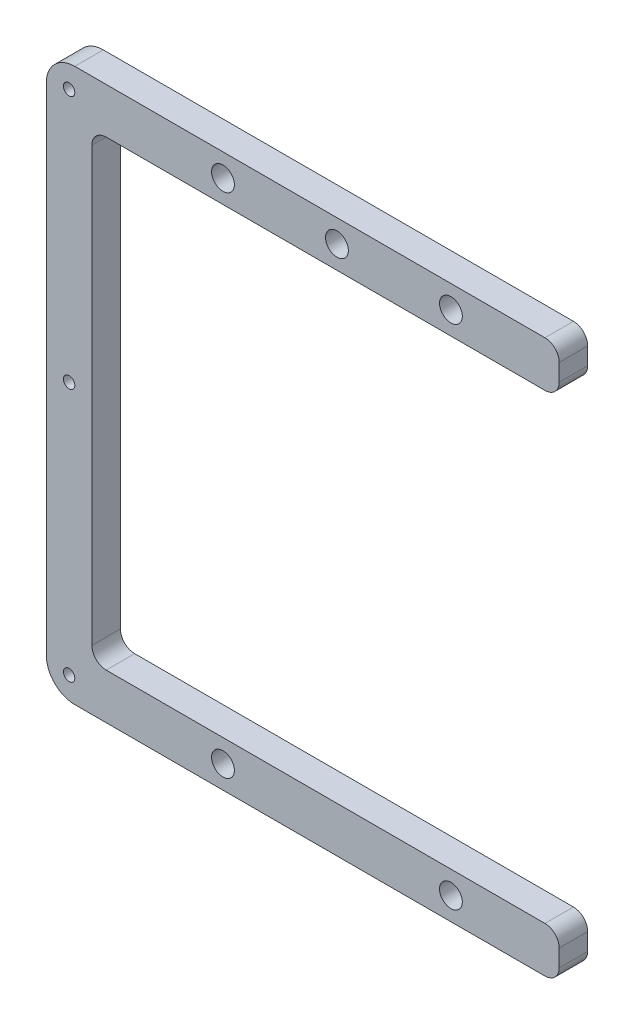
ISO-10303-21;
HEADER;
FILE_DESCRIPTION(('STEP AP214'),'2;1');
FILE_NAME('part.step','',(''),(''),'','','');
FILE_SCHEMA(('AUTOMOTIVE_DESIGN { 1 0 10303 214 1 1 1 1 }'));
ENDSEC;
DATA;
#1=APPLICATION_CONTEXT('core data for automotive mechanical design processes');
#2=APPLICATION_PROTOCOL_DEFINITION('international standard','automotive_design',2000,#1);
#3=PRODUCT_CONTEXT('',#1,'mechanical');
#4=PRODUCT('Part','Part','',(#3));
#5=PRODUCT_RELATED_PRODUCT_CATEGORY('part','',(#4));
#6=PRODUCT_DEFINITION_FORMATION('','',#4);
#7=PRODUCT_DEFINITION_CONTEXT('part definition',#1,'design');
#8=PRODUCT_DEFINITION('design','',#6,#7);
#9=PRODUCT_DEFINITION_SHAPE('','',#8);
#10=(LENGTH_UNIT() NAMED_UNIT(*) SI_UNIT(.MILLI.,.METRE.));
#11=(NAMED_UNIT(*) PLANE_ANGLE_UNIT() SI_UNIT($,.RADIAN.));
#12=(NAMED_UNIT(*) SI_UNIT($,.STERADIAN.) SOLID_ANGLE_UNIT());
#13=UNCERTAINTY_MEASURE_WITH_UNIT(LENGTH_MEASURE(1.E-05),#10,'distance_accuracy_value','');
#14=(GEOMETRIC_REPRESENTATION_CONTEXT(3) GLOBAL_UNCERTAINTY_ASSIGNED_CONTEXT((#13)) GLOBAL_UNIT_ASSIGNED_CONTEXT((#10,
#11,#12)) REPRESENTATION_CONTEXT('',''));
#15=CARTESIAN_POINT('',(0.,0.,0.));
#16=DIRECTION('',(0.,0.,1.));
#17=DIRECTION('',(1.,0.,0.));
#18=AXIS2_PLACEMENT_3D('',#15,#16,#17);
#19=CARTESIAN_POINT('',(5.,-43.5,5.));
#20=DIRECTION('',(0.,0.,-1.));
#21=DIRECTION('',(-1.,0.,0.));
#22=AXIS2_PLACEMENT_3D('',#19,#20,#21);
#23=CYLINDRICAL_SURFACE('',#22,5.);
#24=CARTESIAN_POINT('',(5.,-43.5,0.));
#25=DIRECTION('',(0.,0.,1.));
#26=DIRECTION('',(1.,0.,0.));
#27=AXIS2_PLACEMENT_3D('',#24,#25,#26);
#28=CIRCLE('',#27,5.);
#29=CARTESIAN_POINT('',(0.,-43.5,0.));
#30=VERTEX_POINT('',#29);
#31=CARTESIAN_POINT('',(5.00000000000001,-48.5,0.));
#32=VERTEX_POINT('',#31);
#33=EDGE_CURVE('E183',#30,#32,#28,.T.);
#34=ORIENTED_EDGE('',*,*,#33,.T.);
#35=DIRECTION('',(0.,0.,-1.));
#36=VECTOR('',#35,1.);
#37=CARTESIAN_POINT('',(5.00000000000001,-48.5,5.));
#38=LINE('',#37,#36);
#39=CARTESIAN_POINT('',(5.00000000000001,-48.5,5.));
#40=VERTEX_POINT('',#39);
#41=EDGE_CURVE('E11',#40,#32,#38,.T.);
#42=ORIENTED_EDGE('',*,*,#41,.F.);
#43=CARTESIAN_POINT('',(5.,-43.5,5.));
#44=DIRECTION('',(0.,0.,1.));
#45=DIRECTION('',(1.,0.,0.));
#46=AXIS2_PLACEMENT_3D('',#43,#44,#45);
#47=CIRCLE('',#46,5.);
#48=CARTESIAN_POINT('',(0.,-43.5,5.));
#49=VERTEX_POINT('',#48);
#50=EDGE_CURVE('E214',#49,#40,#47,.T.);
#51=ORIENTED_EDGE('',*,*,#50,.F.);
#52=DIRECTION('',(0.,0.,-1.));
#53=VECTOR('',#52,1.);
#54=CARTESIAN_POINT('',(0.,-43.5,5.));
#55=LINE('',#54,#53);
#56=EDGE_CURVE('E179',#49,#30,#55,.T.);
#57=ORIENTED_EDGE('',*,*,#56,.T.);
#58=EDGE_LOOP('',(#34,#42,#51,#57));
#59=FACE_BOUND('',#58,.T.);
#60=ADVANCED_FACE('F39',(#59),#23,.T.);
#61=CARTESIAN_POINT('',(87.5,-48.5,5.));
#62=DIRECTION('',(0.,1.,0.));
#63=DIRECTION('',(-1.,0.,0.));
#64=AXIS2_PLACEMENT_3D('',#61,#62,#63);
#65=PLANE('',#64);
#66=DIRECTION('',(1.,0.,0.));
#67=VECTOR('',#66,1.);
#68=CARTESIAN_POINT('',(87.5,-48.5,0.));
#69=LINE('',#68,#67);
#70=CARTESIAN_POINT('',(87.5,-48.5,0.));
#71=VERTEX_POINT('',#70);
#72=EDGE_CURVE('E186',#32,#71,#69,.T.);
#73=ORIENTED_EDGE('',*,*,#72,.T.);
#74=DIRECTION('',(0.,0.,-1.));
#75=VECTOR('',#74,1.);
#76=CARTESIAN_POINT('',(87.5,-48.5,5.));
#77=LINE('',#76,#75);
#78=CARTESIAN_POINT('',(87.5,-48.5,5.));
#79=VERTEX_POINT('',#78);
#80=EDGE_CURVE('E47',#79,#71,#77,.T.);
#81=ORIENTED_EDGE('',*,*,#80,.F.);
#82=DIRECTION('',(1.,0.,0.));
#83=VECTOR('',#82,1.);
#84=CARTESIAN_POINT('',(87.5,-48.5,5.));
#85=LINE('',#84,#83);
#86=EDGE_CURVE('E122',#40,#79,#85,.T.);
#87=ORIENTED_EDGE('',*,*,#86,.F.);
#88=ORIENTED_EDGE('',*,*,#41,.T.);
#89=EDGE_LOOP('',(#73,#81,#87,#88));
#90=FACE_BOUND('',#89,.T.);
#91=ADVANCED_FACE('F313',(#90),#65,.F.);
#92=CARTESIAN_POINT('',(87.5,-46.,5.));
#93=DIRECTION('',(0.,0.,-1.));
#94=DIRECTION('',(-1.,0.,0.));
#95=AXIS2_PLACEMENT_3D('',#92,#93,#94);
#96=CYLINDRICAL_SURFACE('',#95,2.5);
#97=CARTESIAN_POINT('',(87.5,-46.,0.));
#98=DIRECTION('',(0.,0.,1.));
#99=DIRECTION('',(-1.,0.,0.));
#100=AXIS2_PLACEMENT_3D('',#97,#98,#99);
#101=CIRCLE('',#100,2.5);
#102=CARTESIAN_POINT('',(90.,-46.,0.));
#103=VERTEX_POINT('',#102);
#104=EDGE_CURVE('E189',#71,#103,#101,.T.);
#105=ORIENTED_EDGE('',*,*,#104,.T.);
#106=DIRECTION('',(0.,0.,-1.));
#107=VECTOR('',#106,1.);
#108=CARTESIAN_POINT('',(90.,-46.,5.));
#109=LINE('',#108,#107);
#110=CARTESIAN_POINT('',(90.,-46.,5.));
#111=VERTEX_POINT('',#110);
#112=EDGE_CURVE('E245',#111,#103,#109,.T.);
#113=ORIENTED_EDGE('',*,*,#112,.F.);
#114=CARTESIAN_POINT('',(87.5,-46.,5.));
#115=DIRECTION('',(0.,0.,1.));
#116=DIRECTION('',(-1.,0.,0.));
#117=AXIS2_PLACEMENT_3D('',#114,#115,#116);
#118=CIRCLE('',#117,2.5);
#119=EDGE_CURVE('E253',#79,#111,#118,.T.);
#120=ORIENTED_EDGE('',*,*,#119,.F.);
#121=ORIENTED_EDGE('',*,*,#80,.T.);
#122=EDGE_LOOP('',(#105,#113,#120,#121));
#123=FACE_BOUND('',#122,.T.);
#124=ADVANCED_FACE('F251',(#123),#96,.T.);
#125=CARTESIAN_POINT('',(90.,-43.,5.));
#126=DIRECTION('',(-1.,0.,0.));
#127=DIRECTION('',(0.,-1.,0.));
#128=AXIS2_PLACEMENT_3D('',#125,#126,#127);
#129=PLANE('',#128);
#130=DIRECTION('',(0.,1.,0.));
#131=VECTOR('',#130,1.);
#132=CARTESIAN_POINT('',(90.,-43.,0.));
#133=LINE('',#132,#131);
#134=CARTESIAN_POINT('',(90.,-43.,0.));
#135=VERTEX_POINT('',#134);
#136=EDGE_CURVE('E191',#103,#135,#133,.T.);
#137=ORIENTED_EDGE('',*,*,#136,.T.);
#138=DIRECTION('',(0.,0.,-1.));
#139=VECTOR('',#138,1.);
#140=CARTESIAN_POINT('',(90.,-43.,5.));
#141=LINE('',#140,#139);
#142=CARTESIAN_POINT('',(90.,-43.,5.));
#143=VERTEX_POINT('',#142);
#144=EDGE_CURVE('E242',#143,#135,#141,.T.);
#145=ORIENTED_EDGE('',*,*,#144,.F.);
#146=DIRECTION('',(0.,1.,0.));
#147=VECTOR('',#146,1.);
#148=CARTESIAN_POINT('',(90.,-43.,5.));
#149=LINE('',#148,#147);
#150=EDGE_CURVE('E271',#111,#143,#149,.T.);
#151=ORIENTED_EDGE('',*,*,#150,.F.);
#152=ORIENTED_EDGE('',*,*,#112,.T.);
#153=EDGE_LOOP('',(#137,#145,#151,#152));
#154=FACE_BOUND('',#153,.T.);
#155=ADVANCED_FACE('F262',(#154),#129,.F.);
#156=CARTESIAN_POINT('',(87.5,-43.,5.));
#157=DIRECTION('',(0.,0.,-1.));
#158=DIRECTION('',(-1.,0.,0.));
#159=AXIS2_PLACEMENT_3D('',#156,#157,#158);
#160=CYLINDRICAL_SURFACE('',#159,2.50000000000001);
#161=CARTESIAN_POINT('',(87.5,-43.,0.));
#162=DIRECTION('',(0.,0.,1.));
#163=DIRECTION('',(1.,0.,0.));
#164=AXIS2_PLACEMENT_3D('',#161,#162,#163);
#165=CIRCLE('',#164,2.50000000000001);
#166=CARTESIAN_POINT('',(87.5,-40.5,0.));
#167=VERTEX_POINT('',#166);
#168=EDGE_CURVE('E193',#135,#167,#165,.T.);
#169=ORIENTED_EDGE('',*,*,#168,.T.);
#170=DIRECTION('',(0.,0.,-1.));
#171=VECTOR('',#170,1.);
#172=CARTESIAN_POINT('',(87.5,-40.5,5.));
#173=LINE('',#172,#171);
#174=CARTESIAN_POINT('',(87.5,-40.5,5.));
#175=VERTEX_POINT('',#174);
#176=EDGE_CURVE('E239',#175,#167,#173,.T.);
#177=ORIENTED_EDGE('',*,*,#176,.F.);
#178=CARTESIAN_POINT('',(87.5,-43.,5.));
#179=DIRECTION('',(0.,0.,1.));
#180=DIRECTION('',(1.,0.,0.));
#181=AXIS2_PLACEMENT_3D('',#178,#179,#180);
#182=CIRCLE('',#181,2.50000000000001);
#183=EDGE_CURVE('E268',#143,#175,#182,.T.);
#184=ORIENTED_EDGE('',*,*,#183,.F.);
#185=ORIENTED_EDGE('',*,*,#144,.T.);
#186=EDGE_LOOP('',(#169,#177,#184,#185));
#187=FACE_BOUND('',#186,.T.);
#188=ADVANCED_FACE('F266',(#187),#160,.T.);
#189=CARTESIAN_POINT('',(10.5,-40.5,5.));
#190=DIRECTION('',(0.,-1.,0.));
#191=DIRECTION('',(1.,0.,0.));
#192=AXIS2_PLACEMENT_3D('',#189,#190,#191);
#193=PLANE('',#192);
#194=DIRECTION('',(-1.,0.,0.));
#195=VECTOR('',#194,1.);
#196=CARTESIAN_POINT('',(10.5,-40.5,0.));
#197=LINE('',#196,#195);
#198=CARTESIAN_POINT('',(10.5,-40.5,0.));
#199=VERTEX_POINT('',#198);
#200=EDGE_CURVE('E195',#167,#199,#197,.T.);
#201=ORIENTED_EDGE('',*,*,#200,.T.);
#202=DIRECTION('',(0.,0.,-1.));
#203=VECTOR('',#202,1.);
#204=CARTESIAN_POINT('',(10.5,-40.5,5.));
#205=LINE('',#204,#203);
#206=CARTESIAN_POINT('',(10.5,-40.5,5.));
#207=VERTEX_POINT('',#206);
#208=EDGE_CURVE('E236',#207,#199,#205,.T.);
#209=ORIENTED_EDGE('',*,*,#208,.F.);
#210=DIRECTION('',(-1.,0.,0.));
#211=VECTOR('',#210,1.);
#212=CARTESIAN_POINT('',(10.5,-40.5,5.));
#213=LINE('',#212,#211);
#214=EDGE_CURVE('E270',#175,#207,#213,.T.);
#215=ORIENTED_EDGE('',*,*,#214,.F.);
#216=ORIENTED_EDGE('',*,*,#176,.T.);
#217=EDGE_LOOP('',(#201,#209,#215,#216));
#218=FACE_BOUND('',#217,.T.);
#219=ADVANCED_FACE('F326',(#218),#193,.F.);
#220=CARTESIAN_POINT('',(10.5,-38.,5.));
#221=DIRECTION('',(0.,0.,-1.));
#222=DIRECTION('',(-1.,0.,0.));
#223=AXIS2_PLACEMENT_3D('',#220,#221,#222);
#224=CYLINDRICAL_SURFACE('',#223,2.50000000000001);
#225=CARTESIAN_POINT('',(10.5,-38.,0.));
#226=DIRECTION('',(0.,0.,-1.));
#227=DIRECTION('',(1.,0.,0.));
#228=AXIS2_PLACEMENT_3D('',#225,#226,#227);
#229=CIRCLE('',#228,2.50000000000001);
#230=CARTESIAN_POINT('',(8.00000000000001,-38.,0.));
#231=VERTEX_POINT('',#230);
#232=EDGE_CURVE('E197',#199,#231,#229,.T.);
#233=ORIENTED_EDGE('',*,*,#232,.T.);
#234=DIRECTION('',(0.,0.,-1.));
#235=VECTOR('',#234,1.);
#236=CARTESIAN_POINT('',(8.00000000000001,-38.,5.));
#237=LINE('',#236,#235);
#238=CARTESIAN_POINT('',(8.00000000000001,-38.,5.));
#239=VERTEX_POINT('',#238);
#240=EDGE_CURVE('E233',#239,#231,#237,.T.);
#241=ORIENTED_EDGE('',*,*,#240,.F.);
#242=CARTESIAN_POINT('',(10.5,-38.,5.));
#243=DIRECTION('',(0.,0.,-1.));
#244=DIRECTION('',(1.,0.,0.));
#245=AXIS2_PLACEMENT_3D('',#242,#243,#244);
#246=CIRCLE('',#245,2.50000000000001);
#247=EDGE_CURVE('E273',#207,#239,#246,.T.);
#248=ORIENTED_EDGE('',*,*,#247,.F.);
#249=ORIENTED_EDGE('',*,*,#208,.T.);
#250=EDGE_LOOP('',(#233,#241,#248,#249));
#251=FACE_BOUND('',#250,.T.);
#252=ADVANCED_FACE('F329',(#251),#224,.F.);
#253=CARTESIAN_POINT('',(8.,38.,5.));
#254=DIRECTION('',(-1.,0.,0.));
#255=DIRECTION('',(0.,-1.,0.));
#256=AXIS2_PLACEMENT_3D('',#253,#254,#255);
#257=PLANE('',#256);
#258=DIRECTION('',(0.,1.,0.));
#259=VECTOR('',#258,1.);
#260=CARTESIAN_POINT('',(8.,38.,0.));
#261=LINE('',#260,#259);
#262=CARTESIAN_POINT('',(8.,38.,0.));
#263=VERTEX_POINT('',#262);
#264=EDGE_CURVE('E199',#231,#263,#261,.T.);
#265=ORIENTED_EDGE('',*,*,#264,.T.);
#266=DIRECTION('',(0.,0.,-1.));
#267=VECTOR('',#266,1.);
#268=CARTESIAN_POINT('',(8.,38.,5.));
#269=LINE('',#268,#267);
#270=CARTESIAN_POINT('',(8.,38.,5.));
#271=VERTEX_POINT('',#270);
#272=EDGE_CURVE('E230',#271,#263,#269,.T.);
#273=ORIENTED_EDGE('',*,*,#272,.F.);
#274=DIRECTION('',(0.,1.,0.));
#275=VECTOR('',#274,1.);
#276=CARTESIAN_POINT('',(8.,38.,5.));
#277=LINE('',#276,#275);
#278=EDGE_CURVE('E279',#239,#271,#277,.T.);
#279=ORIENTED_EDGE('',*,*,#278,.F.);
#280=ORIENTED_EDGE('',*,*,#240,.T.);
#281=EDGE_LOOP('',(#265,#273,#279,#280));
#282=FACE_BOUND('',#281,.T.);
#283=ADVANCED_FACE('F333',(#282),#257,.F.);
#284=CARTESIAN_POINT('',(10.5,38.,5.));
#285=DIRECTION('',(0.,0.,-1.));
#286=DIRECTION('',(-1.,0.,0.));
#287=AXIS2_PLACEMENT_3D('',#284,#285,#286);
#288=CYLINDRICAL_SURFACE('',#287,2.50000000000001);
#289=CARTESIAN_POINT('',(10.5,38.,0.));
#290=DIRECTION('',(0.,0.,-1.));
#291=DIRECTION('',(1.,0.,0.));
#292=AXIS2_PLACEMENT_3D('',#289,#290,#291);
#293=CIRCLE('',#292,2.50000000000001);
#294=CARTESIAN_POINT('',(10.5,40.5,0.));
#295=VERTEX_POINT('',#294);
#296=EDGE_CURVE('E201',#263,#295,#293,.T.);
#297=ORIENTED_EDGE('',*,*,#296,.T.);
#298=DIRECTION('',(0.,0.,-1.));
#299=VECTOR('',#298,1.);
#300=CARTESIAN_POINT('',(10.5,40.5,5.));
#301=LINE('',#300,#299);
#302=CARTESIAN_POINT('',(10.5,40.5,5.));
#303=VERTEX_POINT('',#302);
#304=EDGE_CURVE('E227',#303,#295,#301,.T.);
#305=ORIENTED_EDGE('',*,*,#304,.F.);
#306=CARTESIAN_POINT('',(10.5,38.,5.));
#307=DIRECTION('',(0.,0.,-1.));
#308=DIRECTION('',(1.,0.,0.));
#309=AXIS2_PLACEMENT_3D('',#306,#307,#308);
#310=CIRCLE('',#309,2.50000000000001);
#311=EDGE_CURVE('E281',#271,#303,#310,.T.);
#312=ORIENTED_EDGE('',*,*,#311,.F.);
#313=ORIENTED_EDGE('',*,*,#272,.T.);
#314=EDGE_LOOP('',(#297,#305,#312,#313));
#315=FACE_BOUND('',#314,.T.);
#316=ADVANCED_FACE('F337',(#315),#288,.F.);
#317=CARTESIAN_POINT('',(87.5,40.5,5.));
#318=DIRECTION('',(0.,1.,0.));
#319=DIRECTION('',(0.,0.,1.));
#320=AXIS2_PLACEMENT_3D('',#317,#318,#319);
#321=PLANE('',#320);
#322=DIRECTION('',(1.,0.,0.));
#323=VECTOR('',#322,1.);
#324=CARTESIAN_POINT('',(87.5,40.5,0.));
#325=LINE('',#324,#323);
#326=CARTESIAN_POINT('',(87.5,40.5,0.));
#327=VERTEX_POINT('',#326);
#328=EDGE_CURVE('E203',#295,#327,#325,.T.);
#329=ORIENTED_EDGE('',*,*,#328,.T.);
#330=DIRECTION('',(0.,0.,-1.));
#331=VECTOR('',#330,1.);
#332=CARTESIAN_POINT('',(87.5,40.5,5.));
#333=LINE('',#332,#331);
#334=CARTESIAN_POINT('',(87.5,40.5,5.));
#335=VERTEX_POINT('',#334);
#336=EDGE_CURVE('E224',#335,#327,#333,.T.);
#337=ORIENTED_EDGE('',*,*,#336,.F.);
#338=DIRECTION('',(1.,0.,0.));
#339=VECTOR('',#338,1.);
#340=CARTESIAN_POINT('',(87.5,40.5,5.));
#341=LINE('',#340,#339);
#342=EDGE_CURVE('E283',#303,#335,#341,.T.);
#343=ORIENTED_EDGE('',*,*,#342,.F.);
#344=ORIENTED_EDGE('',*,*,#304,.T.);
#345=EDGE_LOOP('',(#329,#337,#343,#344));
#346=FACE_BOUND('',#345,.T.);
#347=ADVANCED_FACE('F341',(#346),#321,.F.);
#348=CARTESIAN_POINT('',(87.5,43.,5.));
#349=DIRECTION('',(0.,0.,-1.));
#350=DIRECTION('',(-1.,0.,0.));
#351=AXIS2_PLACEMENT_3D('',#348,#349,#350);
#352=CYLINDRICAL_SURFACE('',#351,2.5);
#353=CARTESIAN_POINT('',(87.5,43.,0.));
#354=DIRECTION('',(0.,0.,1.));
#355=DIRECTION('',(-1.,0.,0.));
#356=AXIS2_PLACEMENT_3D('',#353,#354,#355);
#357=CIRCLE('',#356,2.5);
#358=CARTESIAN_POINT('',(90.,43.,0.));
#359=VERTEX_POINT('',#358);
#360=EDGE_CURVE('E205',#327,#359,#357,.T.);
#361=ORIENTED_EDGE('',*,*,#360,.T.);
#362=DIRECTION('',(0.,0.,-1.));
#363=VECTOR('',#362,1.);
#364=CARTESIAN_POINT('',(90.,43.,5.));
#365=LINE('',#364,#363);
#366=CARTESIAN_POINT('',(90.,43.,5.));
#367=VERTEX_POINT('',#366);
#368=EDGE_CURVE('E221',#367,#359,#365,.T.);
#369=ORIENTED_EDGE('',*,*,#368,.F.);
#370=CARTESIAN_POINT('',(87.5,43.,5.));
#371=DIRECTION('',(0.,0.,1.));
#372=DIRECTION('',(-1.,0.,0.));
#373=AXIS2_PLACEMENT_3D('',#370,#371,#372);
#374=CIRCLE('',#373,2.5);
#375=EDGE_CURVE('E285',#335,#367,#374,.T.);
#376=ORIENTED_EDGE('',*,*,#375,.F.);
#377=ORIENTED_EDGE('',*,*,#336,.T.);
#378=EDGE_LOOP('',(#361,#369,#376,#377));
#379=FACE_BOUND('',#378,.T.);
#380=ADVANCED_FACE('F345',(#379),#352,.T.);
#381=CARTESIAN_POINT('',(90.,46.,5.));
#382=DIRECTION('',(-1.,0.,0.));
#383=DIRECTION('',(0.,0.,1.));
#384=AXIS2_PLACEMENT_3D('',#381,#382,#383);
#385=PLANE('',#384);
#386=DIRECTION('',(0.,1.,0.));
#387=VECTOR('',#386,1.);
#388=CARTESIAN_POINT('',(90.,46.,0.));
#389=LINE('',#388,#387);
#390=CARTESIAN_POINT('',(90.,46.,0.));
#391=VERTEX_POINT('',#390);
#392=EDGE_CURVE('E207',#359,#391,#389,.T.);
#393=ORIENTED_EDGE('',*,*,#392,.T.);
#394=DIRECTION('',(0.,0.,-1.));
#395=VECTOR('',#394,1.);
#396=CARTESIAN_POINT('',(90.,46.,5.));
#397=LINE('',#396,#395);
#398=CARTESIAN_POINT('',(90.,46.,5.));
#399=VERTEX_POINT('',#398);
#400=EDGE_CURVE('E218',#399,#391,#397,.T.);
#401=ORIENTED_EDGE('',*,*,#400,.F.);
#402=DIRECTION('',(0.,1.,0.));
#403=VECTOR('',#402,1.);
#404=CARTESIAN_POINT('',(90.,46.,5.));
#405=LINE('',#404,#403);
#406=EDGE_CURVE('E287',#367,#399,#405,.T.);
#407=ORIENTED_EDGE('',*,*,#406,.F.);
#408=ORIENTED_EDGE('',*,*,#368,.T.);
#409=EDGE_LOOP('',(#393,#401,#407,#408));
#410=FACE_BOUND('',#409,.T.);
#411=ADVANCED_FACE('F293',(#410),#385,.F.);
#412=CARTESIAN_POINT('',(87.5,46.,5.));
#413=DIRECTION('',(0.,0.,-1.));
#414=DIRECTION('',(-1.,0.,0.));
#415=AXIS2_PLACEMENT_3D('',#412,#413,#414);
#416=CYLINDRICAL_SURFACE('',#415,2.5);
#417=CARTESIAN_POINT('',(87.5,46.,0.));
#418=DIRECTION('',(0.,0.,1.));
#419=DIRECTION('',(-1.,0.,0.));
#420=AXIS2_PLACEMENT_3D('',#417,#418,#419);
#421=CIRCLE('',#420,2.5);
#422=CARTESIAN_POINT('',(87.5,48.5,0.));
#423=VERTEX_POINT('',#422);
#424=EDGE_CURVE('E209',#391,#423,#421,.T.);
#425=ORIENTED_EDGE('',*,*,#424,.T.);
#426=DIRECTION('',(0.,0.,-1.));
#427=VECTOR('',#426,1.);
#428=CARTESIAN_POINT('',(87.5,48.5,5.));
#429=LINE('',#428,#427);
#430=CARTESIAN_POINT('',(87.5,48.5,5.));
#431=VERTEX_POINT('',#430);
#432=EDGE_CURVE('E174',#431,#423,#429,.T.);
#433=ORIENTED_EDGE('',*,*,#432,.F.);
#434=CARTESIAN_POINT('',(87.5,46.,5.));
#435=DIRECTION('',(0.,0.,1.));
#436=DIRECTION('',(-1.,0.,0.));
#437=AXIS2_PLACEMENT_3D('',#434,#435,#436);
#438=CIRCLE('',#437,2.5);
#439=EDGE_CURVE('E165',#399,#431,#438,.T.);
#440=ORIENTED_EDGE('',*,*,#439,.F.);
#441=ORIENTED_EDGE('',*,*,#400,.T.);
#442=EDGE_LOOP('',(#425,#433,#440,#441));
#443=FACE_BOUND('',#442,.T.);
#444=ADVANCED_FACE('F297',(#443),#416,.T.);
#445=CARTESIAN_POINT('',(4.99999999999999,48.5,5.));
#446=DIRECTION('',(0.,-1.,0.));
#447=DIRECTION('',(0.,0.,-1.));
#448=AXIS2_PLACEMENT_3D('',#445,#446,#447);
#449=PLANE('',#448);
#450=DIRECTION('',(-1.,0.,0.));
#451=VECTOR('',#450,1.);
#452=CARTESIAN_POINT('',(4.99999999999999,48.5,0.));
#453=LINE('',#452,#451);
#454=CARTESIAN_POINT('',(4.99999999999999,48.5,0.));
#455=VERTEX_POINT('',#454);
#456=EDGE_CURVE('E173',#423,#455,#453,.T.);
#457=ORIENTED_EDGE('',*,*,#456,.T.);
#458=DIRECTION('',(0.,0.,-1.));
#459=VECTOR('',#458,1.);
#460=CARTESIAN_POINT('',(4.99999999999999,48.5,5.));
#461=LINE('',#460,#459);
#462=CARTESIAN_POINT('',(4.99999999999999,48.5,5.));
#463=VERTEX_POINT('',#462);
#464=EDGE_CURVE('E170',#463,#455,#461,.T.);
#465=ORIENTED_EDGE('',*,*,#464,.F.);
#466=DIRECTION('',(-1.,0.,0.));
#467=VECTOR('',#466,1.);
#468=CARTESIAN_POINT('',(4.99999999999999,48.5,5.));
#469=LINE('',#468,#467);
#470=EDGE_CURVE('E159',#431,#463,#469,.T.);
#471=ORIENTED_EDGE('',*,*,#470,.F.);
#472=ORIENTED_EDGE('',*,*,#432,.T.);
#473=EDGE_LOOP('',(#457,#465,#471,#472));
#474=FACE_BOUND('',#473,.T.);
#475=ADVANCED_FACE('F171',(#474),#449,.F.);
#476=CARTESIAN_POINT('',(4.99999999999999,43.5,5.));
#477=DIRECTION('',(0.,0.,-1.));
#478=DIRECTION('',(-1.,0.,0.));
#479=AXIS2_PLACEMENT_3D('',#476,#477,#478);
#480=CYLINDRICAL_SURFACE('',#479,5.);
#481=CARTESIAN_POINT('',(4.99999999999999,43.5,0.));
#482=DIRECTION('',(0.,0.,1.));
#483=DIRECTION('',(-1.,0.,0.));
#484=AXIS2_PLACEMENT_3D('',#481,#482,#483);
#485=CIRCLE('',#484,5.);
#486=CARTESIAN_POINT('',(0.,43.5,0.));
#487=VERTEX_POINT('',#486);
#488=EDGE_CURVE('E108',#455,#487,#485,.T.);
#489=ORIENTED_EDGE('',*,*,#488,.T.);
#490=DIRECTION('',(0.,0.,-1.));
#491=VECTOR('',#490,1.);
#492=CARTESIAN_POINT('',(0.,43.5,5.));
#493=LINE('',#492,#491);
#494=CARTESIAN_POINT('',(0.,43.5,5.));
#495=VERTEX_POINT('',#494);
#496=EDGE_CURVE('E175',#495,#487,#493,.T.);
#497=ORIENTED_EDGE('',*,*,#496,.F.);
#498=CARTESIAN_POINT('',(4.99999999999999,43.5,5.));
#499=DIRECTION('',(0.,0.,1.));
#500=DIRECTION('',(-1.,0.,0.));
#501=AXIS2_PLACEMENT_3D('',#498,#499,#500);
#502=CIRCLE('',#501,5.);
#503=EDGE_CURVE('E163',#463,#495,#502,.T.);
#504=ORIENTED_EDGE('',*,*,#503,.F.);
#505=ORIENTED_EDGE('',*,*,#464,.T.);
#506=EDGE_LOOP('',(#489,#497,#504,#505));
#507=FACE_BOUND('',#506,.T.);
#508=ADVANCED_FACE('F177',(#507),#480,.T.);
#509=CARTESIAN_POINT('',(0.,-43.5,5.));
#510=DIRECTION('',(1.,0.,0.));
#511=DIRECTION('',(0.,1.,0.));
#512=AXIS2_PLACEMENT_3D('',#509,#510,#511);
#513=PLANE('',#512);
#514=DIRECTION('',(0.,-1.,0.));
#515=VECTOR('',#514,1.);
#516=CARTESIAN_POINT('',(0.,-43.5,0.));
#517=LINE('',#516,#515);
#518=EDGE_CURVE('E114',#487,#30,#517,.T.);
#519=ORIENTED_EDGE('',*,*,#518,.T.);
#520=ORIENTED_EDGE('',*,*,#56,.F.);
#521=DIRECTION('',(0.,-1.,0.));
#522=VECTOR('',#521,1.);
#523=CARTESIAN_POINT('',(0.,-43.5,5.));
#524=LINE('',#523,#522);
#525=EDGE_CURVE('E55',#495,#49,#524,.T.);
#526=ORIENTED_EDGE('',*,*,#525,.F.);
#527=ORIENTED_EDGE('',*,*,#496,.T.);
#528=EDGE_LOOP('',(#519,#520,#526,#527));
#529=FACE_BOUND('',#528,.T.);
#530=ADVANCED_FACE('F301',(#529),#513,.F.);
#531=CARTESIAN_POINT('',(5.,-43.5,5.));
#532=DIRECTION('',(0.,0.,1.));
#533=DIRECTION('',(1.,0.,0.));
#534=AXIS2_PLACEMENT_3D('',#531,#532,#533);
#535=PLANE('',#534);
#536=CARTESIAN_POINT('',(3.99999999999999,44.5,5.));
#537=DIRECTION('',(0.,0.,1.));
#538=DIRECTION('',(1.,0.,0.));
#539=AXIS2_PLACEMENT_3D('',#536,#537,#538);
#540=CIRCLE('',#539,1.);
#541=CARTESIAN_POINT('',(4.99999999999999,44.5,5.));
#542=VERTEX_POINT('',#541);
#543=EDGE_CURVE('E630',#542,#542,#540,.T.);
#544=ORIENTED_EDGE('',*,*,#543,.F.);
#545=EDGE_LOOP('',(#544));
#546=FACE_BOUND('',#545,.T.);
#547=CARTESIAN_POINT('',(4.,-44.5,5.));
#548=DIRECTION('',(0.,0.,1.));
#549=DIRECTION('',(1.,0.,0.));
#550=AXIS2_PLACEMENT_3D('',#547,#548,#549);
#551=CIRCLE('',#550,1.);
#552=CARTESIAN_POINT('',(5.,-44.5,5.));
#553=VERTEX_POINT('',#552);
#554=EDGE_CURVE('E644',#553,#553,#551,.T.);
#555=ORIENTED_EDGE('',*,*,#554,.F.);
#556=EDGE_LOOP('',(#555));
#557=FACE_BOUND('',#556,.T.);
#558=CARTESIAN_POINT('',(4.,0.,5.));
#559=DIRECTION('',(0.,0.,1.));
#560=DIRECTION('',(1.,0.,0.));
#561=AXIS2_PLACEMENT_3D('',#558,#559,#560);
#562=CIRCLE('',#561,1.);
#563=CARTESIAN_POINT('',(5.,0.,5.));
#564=VERTEX_POINT('',#563);
#565=EDGE_CURVE('E641',#564,#564,#562,.T.);
#566=ORIENTED_EDGE('',*,*,#565,.F.);
#567=EDGE_LOOP('',(#566));
#568=FACE_BOUND('',#567,.T.);
#569=CARTESIAN_POINT('',(31.,44.5,5.));
#570=DIRECTION('',(0.,0.,1.));
#571=DIRECTION('',(1.,0.,0.));
#572=AXIS2_PLACEMENT_3D('',#569,#570,#571);
#573=CIRCLE('',#572,2.00000000000001);
#574=CARTESIAN_POINT('',(33.,44.5,5.));
#575=VERTEX_POINT('',#574);
#576=EDGE_CURVE('E657',#575,#575,#573,.T.);
#577=ORIENTED_EDGE('',*,*,#576,.F.);
#578=EDGE_LOOP('',(#577));
#579=FACE_BOUND('',#578,.T.);
#580=CARTESIAN_POINT('',(71.,-44.5,5.));
#581=DIRECTION('',(0.,0.,1.));
#582=DIRECTION('',(-1.,0.,0.));
#583=AXIS2_PLACEMENT_3D('',#580,#581,#582);
#584=CIRCLE('',#583,2.);
#585=CARTESIAN_POINT('',(69.,-44.5,5.));
#586=VERTEX_POINT('',#585);
#587=EDGE_CURVE('E664',#586,#586,#584,.T.);
#588=ORIENTED_EDGE('',*,*,#587,.F.);
#589=EDGE_LOOP('',(#588));
#590=FACE_BOUND('',#589,.T.);
#591=CARTESIAN_POINT('',(31.,-44.5,5.));
#592=DIRECTION('',(0.,0.,1.));
#593=DIRECTION('',(-1.,0.,0.));
#594=AXIS2_PLACEMENT_3D('',#591,#592,#593);
#595=CIRCLE('',#594,2.00000000000001);
#596=CARTESIAN_POINT('',(29.,-44.5,5.));
#597=VERTEX_POINT('',#596);
#598=EDGE_CURVE('E645',#597,#597,#595,.T.);
#599=ORIENTED_EDGE('',*,*,#598,.F.);
#600=EDGE_LOOP('',(#599));
#601=FACE_BOUND('',#600,.T.);
#602=CARTESIAN_POINT('',(51.,44.5,5.));
#603=DIRECTION('',(0.,0.,1.));
#604=DIRECTION('',(1.,0.,0.));
#605=AXIS2_PLACEMENT_3D('',#602,#603,#604);
#606=CIRCLE('',#605,2.);
#607=CARTESIAN_POINT('',(53.,44.5,5.));
#608=VERTEX_POINT('',#607);
#609=EDGE_CURVE('E652',#608,#608,#606,.T.);
#610=ORIENTED_EDGE('',*,*,#609,.F.);
#611=EDGE_LOOP('',(#610));
#612=FACE_BOUND('',#611,.T.);
#613=CARTESIAN_POINT('',(71.,44.5,5.));
#614=DIRECTION('',(0.,0.,1.));
#615=DIRECTION('',(1.,0.,0.));
#616=AXIS2_PLACEMENT_3D('',#613,#614,#615);
#617=CIRCLE('',#616,2.);
#618=CARTESIAN_POINT('',(73.,44.5,5.));
#619=VERTEX_POINT('',#618);
#620=EDGE_CURVE('E660',#619,#619,#617,.T.);
#621=ORIENTED_EDGE('',*,*,#620,.F.);
#622=EDGE_LOOP('',(#621));
#623=FACE_BOUND('',#622,.T.);
#624=ORIENTED_EDGE('',*,*,#50,.T.);
#625=ORIENTED_EDGE('',*,*,#86,.T.);
#626=ORIENTED_EDGE('',*,*,#119,.T.);
#627=ORIENTED_EDGE('',*,*,#150,.T.);
#628=ORIENTED_EDGE('',*,*,#183,.T.);
#629=ORIENTED_EDGE('',*,*,#214,.T.);
#630=ORIENTED_EDGE('',*,*,#247,.T.);
#631=ORIENTED_EDGE('',*,*,#278,.T.);
#632=ORIENTED_EDGE('',*,*,#311,.T.);
#633=ORIENTED_EDGE('',*,*,#342,.T.);
#634=ORIENTED_EDGE('',*,*,#375,.T.);
#635=ORIENTED_EDGE('',*,*,#406,.T.);
#636=ORIENTED_EDGE('',*,*,#439,.T.);
#637=ORIENTED_EDGE('',*,*,#470,.T.);
#638=ORIENTED_EDGE('',*,*,#503,.T.);
#639=ORIENTED_EDGE('',*,*,#525,.T.);
#640=EDGE_LOOP('',(#624,#625,#626,#627,#628,#629,#630,#631,#632,#633,#634,#635,#636,#637,#638,#639));
#641=FACE_BOUND('',#640,.T.);
#642=ADVANCED_FACE('F161',(#546,#557,#568,#579,#590,#601,#612,#623,#641),#535,.T.);
#643=CARTESIAN_POINT('',(5.,-43.5,0.));
#644=DIRECTION('',(0.,0.,1.));
#645=DIRECTION('',(1.,0.,0.));
#646=AXIS2_PLACEMENT_3D('',#643,#644,#645);
#647=PLANE('',#646);
#648=CARTESIAN_POINT('',(31.,44.5,0.));
#649=DIRECTION('',(0.,0.,1.));
#650=DIRECTION('',(1.,0.,0.));
#651=AXIS2_PLACEMENT_3D('',#648,#649,#650);
#652=CIRCLE('',#651,2.00000000000001);
#653=CARTESIAN_POINT('',(33.,44.5,0.));
#654=VERTEX_POINT('',#653);
#655=EDGE_CURVE('E661',#654,#654,#652,.T.);
#656=ORIENTED_EDGE('',*,*,#655,.T.);
#657=EDGE_LOOP('',(#656));
#658=FACE_BOUND('',#657,.T.);
#659=CARTESIAN_POINT('',(71.,-44.5,0.));
#660=DIRECTION('',(0.,0.,1.));
#661=DIRECTION('',(-1.,0.,0.));
#662=AXIS2_PLACEMENT_3D('',#659,#660,#661);
#663=CIRCLE('',#662,2.);
#664=CARTESIAN_POINT('',(69.,-44.5,0.));
#665=VERTEX_POINT('',#664);
#666=EDGE_CURVE('E648',#665,#665,#663,.T.);
#667=ORIENTED_EDGE('',*,*,#666,.T.);
#668=EDGE_LOOP('',(#667));
#669=FACE_BOUND('',#668,.T.);
#670=CARTESIAN_POINT('',(31.,-44.5,0.));
#671=DIRECTION('',(0.,0.,1.));
#672=DIRECTION('',(-1.,0.,0.));
#673=AXIS2_PLACEMENT_3D('',#670,#671,#672);
#674=CIRCLE('',#673,2.00000000000001);
#675=CARTESIAN_POINT('',(29.,-44.5,0.));
#676=VERTEX_POINT('',#675);
#677=EDGE_CURVE('E649',#676,#676,#674,.T.);
#678=ORIENTED_EDGE('',*,*,#677,.T.);
#679=EDGE_LOOP('',(#678));
#680=FACE_BOUND('',#679,.T.);
#681=CARTESIAN_POINT('',(51.,44.5,0.));
#682=DIRECTION('',(0.,0.,1.));
#683=DIRECTION('',(1.,0.,0.));
#684=AXIS2_PLACEMENT_3D('',#681,#682,#683);
#685=CIRCLE('',#684,2.);
#686=CARTESIAN_POINT('',(53.,44.5,0.));
#687=VERTEX_POINT('',#686);
#688=EDGE_CURVE('E640',#687,#687,#685,.T.);
#689=ORIENTED_EDGE('',*,*,#688,.T.);
#690=EDGE_LOOP('',(#689));
#691=FACE_BOUND('',#690,.T.);
#692=CARTESIAN_POINT('',(71.,44.5,0.));
#693=DIRECTION('',(0.,0.,1.));
#694=DIRECTION('',(1.,0.,0.));
#695=AXIS2_PLACEMENT_3D('',#692,#693,#694);
#696=CIRCLE('',#695,2.);
#697=CARTESIAN_POINT('',(73.,44.5,0.));
#698=VERTEX_POINT('',#697);
#699=EDGE_CURVE('E187',#698,#698,#696,.T.);
#700=ORIENTED_EDGE('',*,*,#699,.T.);
#701=EDGE_LOOP('',(#700));
#702=FACE_BOUND('',#701,.T.);
#703=ORIENTED_EDGE('',*,*,#33,.F.);
#704=ORIENTED_EDGE('',*,*,#518,.F.);
#705=ORIENTED_EDGE('',*,*,#488,.F.);
#706=ORIENTED_EDGE('',*,*,#456,.F.);
#707=ORIENTED_EDGE('',*,*,#424,.F.);
#708=ORIENTED_EDGE('',*,*,#392,.F.);
#709=ORIENTED_EDGE('',*,*,#360,.F.);
#710=ORIENTED_EDGE('',*,*,#328,.F.);
#711=ORIENTED_EDGE('',*,*,#296,.F.);
#712=ORIENTED_EDGE('',*,*,#264,.F.);
#713=ORIENTED_EDGE('',*,*,#232,.F.);
#714=ORIENTED_EDGE('',*,*,#200,.F.);
#715=ORIENTED_EDGE('',*,*,#168,.F.);
#716=ORIENTED_EDGE('',*,*,#136,.F.);
#717=ORIENTED_EDGE('',*,*,#104,.F.);
#718=ORIENTED_EDGE('',*,*,#72,.F.);
#719=EDGE_LOOP('',(#703,#704,#705,#706,#707,#708,#709,#710,#711,#712,#713,#714,#715,#716,#717,#718));
#720=FACE_BOUND('',#719,.T.);
#721=ADVANCED_FACE('F257',(#658,#669,#680,#691,#702,#720),#647,.F.);
#722=CARTESIAN_POINT('',(71.,44.5,0.));
#723=DIRECTION('',(0.,0.,1.));
#724=DIRECTION('',(1.,0.,0.));
#725=AXIS2_PLACEMENT_3D('',#722,#723,#724);
#726=CYLINDRICAL_SURFACE('',#725,2.);
#727=ORIENTED_EDGE('',*,*,#699,.F.);
#728=EDGE_LOOP('',(#727));
#729=FACE_BOUND('',#728,.T.);
#730=ORIENTED_EDGE('',*,*,#620,.T.);
#731=EDGE_LOOP('',(#730));
#732=FACE_BOUND('',#731,.T.);
#733=ADVANCED_FACE('F379',(#729,#732),#726,.F.);
#734=CARTESIAN_POINT('',(51.,44.5,0.));
#735=DIRECTION('',(0.,0.,1.));
#736=DIRECTION('',(1.,0.,0.));
#737=AXIS2_PLACEMENT_3D('',#734,#735,#736);
#738=CYLINDRICAL_SURFACE('',#737,2.);
#739=ORIENTED_EDGE('',*,*,#688,.F.);
#740=EDGE_LOOP('',(#739));
#741=FACE_BOUND('',#740,.T.);
#742=ORIENTED_EDGE('',*,*,#609,.T.);
#743=EDGE_LOOP('',(#742));
#744=FACE_BOUND('',#743,.T.);
#745=ADVANCED_FACE('F389',(#741,#744),#738,.F.);
#746=CARTESIAN_POINT('',(31.,-44.5,0.));
#747=DIRECTION('',(0.,0.,1.));
#748=DIRECTION('',(1.,0.,0.));
#749=AXIS2_PLACEMENT_3D('',#746,#747,#748);
#750=CYLINDRICAL_SURFACE('',#749,2.00000000000001);
#751=ORIENTED_EDGE('',*,*,#677,.F.);
#752=EDGE_LOOP('',(#751));
#753=FACE_BOUND('',#752,.T.);
#754=ORIENTED_EDGE('',*,*,#598,.T.);
#755=EDGE_LOOP('',(#754));
#756=FACE_BOUND('',#755,.T.);
#757=ADVANCED_FACE('F400',(#753,#756),#750,.F.);
#758=CARTESIAN_POINT('',(71.,-44.5,0.));
#759=DIRECTION('',(0.,0.,1.));
#760=DIRECTION('',(1.,0.,0.));
#761=AXIS2_PLACEMENT_3D('',#758,#759,#760);
#762=CYLINDRICAL_SURFACE('',#761,2.);
#763=ORIENTED_EDGE('',*,*,#666,.F.);
#764=EDGE_LOOP('',(#763));
#765=FACE_BOUND('',#764,.T.);
#766=ORIENTED_EDGE('',*,*,#587,.T.);
#767=EDGE_LOOP('',(#766));
#768=FACE_BOUND('',#767,.T.);
#769=ADVANCED_FACE('F411',(#765,#768),#762,.F.);
#770=CARTESIAN_POINT('',(31.,44.5,0.));
#771=DIRECTION('',(0.,0.,1.));
#772=DIRECTION('',(1.,0.,0.));
#773=AXIS2_PLACEMENT_3D('',#770,#771,#772);
#774=CYLINDRICAL_SURFACE('',#773,2.00000000000001);
#775=ORIENTED_EDGE('',*,*,#655,.F.);
#776=EDGE_LOOP('',(#775));
#777=FACE_BOUND('',#776,.T.);
#778=ORIENTED_EDGE('',*,*,#576,.T.);
#779=EDGE_LOOP('',(#778));
#780=FACE_BOUND('',#779,.T.);
#781=ADVANCED_FACE('F422',(#777,#780),#774,.F.);
#782=CARTESIAN_POINT('',(4.,0.,2.));
#783=DIRECTION('',(0.,0.,1.));
#784=DIRECTION('',(1.,0.,0.));
#785=AXIS2_PLACEMENT_3D('',#782,#783,#784);
#786=CYLINDRICAL_SURFACE('',#785,1.);
#787=CARTESIAN_POINT('',(4.,0.,2.));
#788=DIRECTION('',(0.,0.,1.));
#789=DIRECTION('',(1.,0.,0.));
#790=AXIS2_PLACEMENT_3D('',#787,#788,#789);
#791=CIRCLE('',#790,1.);
#792=CARTESIAN_POINT('',(5.,0.,2.));
#793=VERTEX_POINT('',#792);
#794=EDGE_CURVE('E637',#793,#793,#791,.T.);
#795=ORIENTED_EDGE('',*,*,#794,.F.);
#796=EDGE_LOOP('',(#795));
#797=FACE_BOUND('',#796,.T.);
#798=ORIENTED_EDGE('',*,*,#565,.T.);
#799=EDGE_LOOP('',(#798));
#800=FACE_BOUND('',#799,.T.);
#801=ADVANCED_FACE('F433',(#797,#800),#786,.F.);
#802=CARTESIAN_POINT('',(4.,0.,2.));
#803=DIRECTION('',(0.,0.,1.));
#804=DIRECTION('',(1.,0.,0.));
#805=AXIS2_PLACEMENT_3D('',#802,#803,#804);
#806=PLANE('',#805);
#807=ORIENTED_EDGE('',*,*,#794,.T.);
#808=EDGE_LOOP('',(#807));
#809=FACE_BOUND('',#808,.T.);
#810=ADVANCED_FACE('F450',(#809),#806,.T.);
#811=CARTESIAN_POINT('',(4.,-44.5,2.));
#812=DIRECTION('',(0.,0.,1.));
#813=DIRECTION('',(1.,0.,0.));
#814=AXIS2_PLACEMENT_3D('',#811,#812,#813);
#815=CYLINDRICAL_SURFACE('',#814,1.);
#816=CARTESIAN_POINT('',(4.,-44.5,2.));
#817=DIRECTION('',(0.,0.,1.));
#818=DIRECTION('',(1.,0.,0.));
#819=AXIS2_PLACEMENT_3D('',#816,#817,#818);
#820=CIRCLE('',#819,1.);
#821=CARTESIAN_POINT('',(5.,-44.5,2.));
#822=VERTEX_POINT('',#821);
#823=EDGE_CURVE('E633',#822,#822,#820,.T.);
#824=ORIENTED_EDGE('',*,*,#823,.F.);
#825=EDGE_LOOP('',(#824));
#826=FACE_BOUND('',#825,.T.);
#827=ORIENTED_EDGE('',*,*,#554,.T.);
#828=EDGE_LOOP('',(#827));
#829=FACE_BOUND('',#828,.T.);
#830=ADVANCED_FACE('F461',(#826,#829),#815,.F.);
#831=CARTESIAN_POINT('',(4.,-44.5,2.));
#832=DIRECTION('',(0.,0.,1.));
#833=DIRECTION('',(1.,0.,0.));
#834=AXIS2_PLACEMENT_3D('',#831,#832,#833);
#835=PLANE('',#834);
#836=ORIENTED_EDGE('',*,*,#823,.T.);
#837=EDGE_LOOP('',(#836));
#838=FACE_BOUND('',#837,.T.);
#839=ADVANCED_FACE('F472',(#838),#835,.T.);
#840=CARTESIAN_POINT('',(3.99999999999999,44.5,2.));
#841=DIRECTION('',(0.,0.,1.));
#842=DIRECTION('',(1.,0.,0.));
#843=AXIS2_PLACEMENT_3D('',#840,#841,#842);
#844=CYLINDRICAL_SURFACE('',#843,1.);
#845=CARTESIAN_POINT('',(3.99999999999999,44.5,2.));
#846=DIRECTION('',(0.,0.,1.));
#847=DIRECTION('',(1.,0.,0.));
#848=AXIS2_PLACEMENT_3D('',#845,#846,#847);
#849=CIRCLE('',#848,1.);
#850=CARTESIAN_POINT('',(4.99999999999999,44.5,2.));
#851=VERTEX_POINT('',#850);
#852=EDGE_CURVE('E629',#851,#851,#849,.T.);
#853=ORIENTED_EDGE('',*,*,#852,.F.);
#854=EDGE_LOOP('',(#853));
#855=FACE_BOUND('',#854,.T.);
#856=ORIENTED_EDGE('',*,*,#543,.T.);
#857=EDGE_LOOP('',(#856));
#858=FACE_BOUND('',#857,.T.);
#859=ADVANCED_FACE('F483',(#855,#858),#844,.F.);
#860=CARTESIAN_POINT('',(3.99999999999999,44.5,2.));
#861=DIRECTION('',(0.,0.,1.));
#862=DIRECTION('',(1.,0.,0.));
#863=AXIS2_PLACEMENT_3D('',#860,#861,#862);
#864=PLANE('',#863);
#865=ORIENTED_EDGE('',*,*,#852,.T.);
#866=EDGE_LOOP('',(#865));
#867=FACE_BOUND('',#866,.T.);
#868=ADVANCED_FACE('F494',(#867),#864,.T.);
#869=CLOSED_SHELL('',(#60,#91,#124,#155,#188,#219,#252,#283,#316,#347,#380,#411,#444,#475,#508,
#530,#642,#721,#733,#745,#757,#769,#781,#801,#810,#830,#839,#859,#868));
#870=MANIFOLD_SOLID_BREP('B2',#869);
#871=ADVANCED_BREP_SHAPE_REPRESENTATION('',(#18,#870),#14);
#872=SHAPE_DEFINITION_REPRESENTATION(#9,#871);
ENDSEC;
END-ISO-10303-21;
